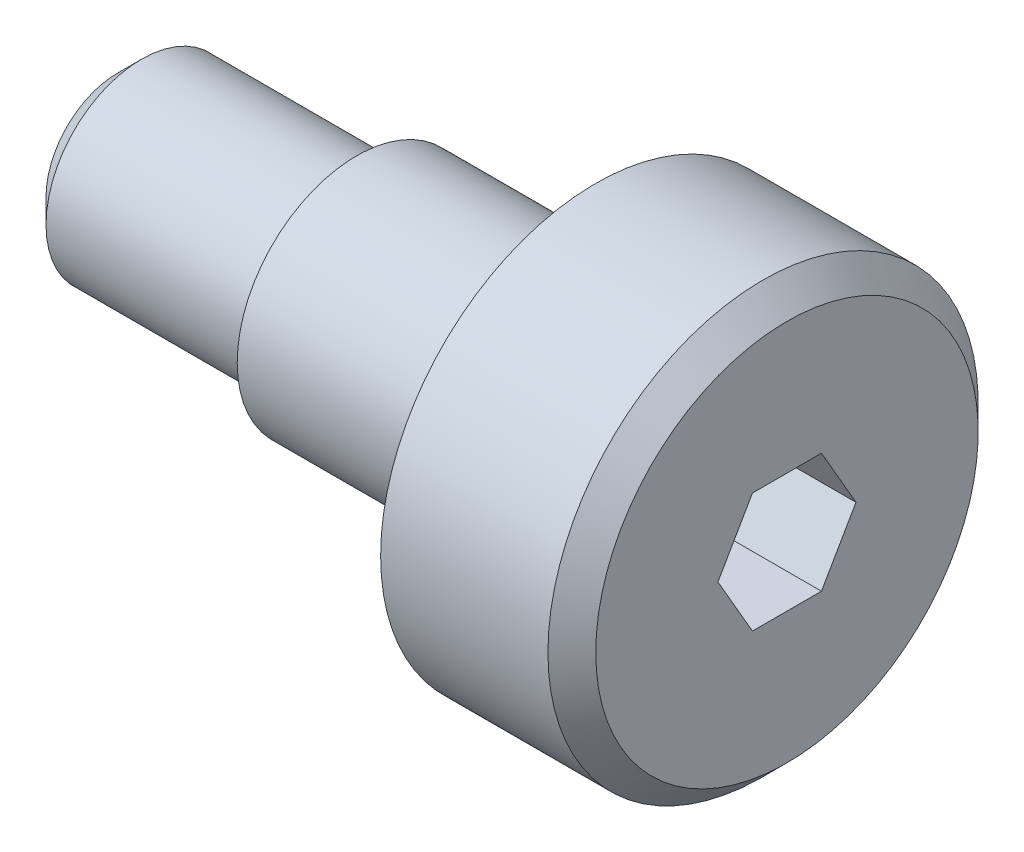
ISO-10303-21;
HEADER;
FILE_DESCRIPTION(('STEP AP214'),'2;1');
FILE_NAME('part.step','',(''),(''),'','','');
FILE_SCHEMA(('AUTOMOTIVE_DESIGN { 1 0 10303 214 1 1 1 1 }'));
ENDSEC;
DATA;
#1=APPLICATION_CONTEXT('core data for automotive mechanical design processes');
#2=APPLICATION_PROTOCOL_DEFINITION('international standard','automotive_design',2000,#1);
#3=PRODUCT_CONTEXT('',#1,'mechanical');
#4=PRODUCT('Part','Part','',(#3));
#5=PRODUCT_RELATED_PRODUCT_CATEGORY('part','',(#4));
#6=PRODUCT_DEFINITION_FORMATION('','',#4);
#7=PRODUCT_DEFINITION_CONTEXT('part definition',#1,'design');
#8=PRODUCT_DEFINITION('design','',#6,#7);
#9=PRODUCT_DEFINITION_SHAPE('','',#8);
#10=(LENGTH_UNIT() NAMED_UNIT(*) SI_UNIT(.MILLI.,.METRE.));
#11=(NAMED_UNIT(*) PLANE_ANGLE_UNIT() SI_UNIT($,.RADIAN.));
#12=(NAMED_UNIT(*) SI_UNIT($,.STERADIAN.) SOLID_ANGLE_UNIT());
#13=UNCERTAINTY_MEASURE_WITH_UNIT(LENGTH_MEASURE(1.E-05),#10,'distance_accuracy_value','');
#14=(GEOMETRIC_REPRESENTATION_CONTEXT(3) GLOBAL_UNCERTAINTY_ASSIGNED_CONTEXT((#13)) GLOBAL_UNIT_ASSIGNED_CONTEXT((#10,
#11,#12)) REPRESENTATION_CONTEXT('',''));
#15=CARTESIAN_POINT('',(0.,0.,0.));
#16=DIRECTION('',(0.,0.,1.));
#17=DIRECTION('',(1.,0.,0.));
#18=AXIS2_PLACEMENT_3D('',#15,#16,#17);
#19=CARTESIAN_POINT('',(0.,1.5,0.));
#20=DIRECTION('',(1.,0.,0.));
#21=DIRECTION('',(0.,0.,-1.));
#22=AXIS2_PLACEMENT_3D('',#19,#20,#21);
#23=PLANE('',#22);
#24=CARTESIAN_POINT('',(0.,0.,0.));
#25=DIRECTION('',(-1.,0.,0.));
#26=DIRECTION('',(0.,0.,1.));
#27=AXIS2_PLACEMENT_3D('',#24,#25,#26);
#28=CIRCLE('',#27,1.5);
#29=CARTESIAN_POINT('',(0.,0.,1.5));
#30=VERTEX_POINT('',#29);
#31=EDGE_CURVE('E138',#30,#30,#28,.T.);
#32=ORIENTED_EDGE('',*,*,#31,.T.);
#33=EDGE_LOOP('',(#32));
#34=FACE_BOUND('',#33,.T.);
#35=ADVANCED_FACE('F37',(#34),#23,.F.);
#36=CARTESIAN_POINT('',(14.,0.,0.));
#37=DIRECTION('',(-1.,0.,0.));
#38=DIRECTION('',(0.,0.,1.));
#39=AXIS2_PLACEMENT_3D('',#36,#37,#38);
#40=PLANE('',#39);
#41=DIRECTION('',(0.,0.866025403784438,0.5));
#42=VECTOR('',#41,1.);
#43=CARTESIAN_POINT('',(14.,0.,-1.44337567297407));
#44=LINE('',#43,#42);
#45=CARTESIAN_POINT('',(14.,0.,-1.44337567297407));
#46=VERTEX_POINT('',#45);
#47=CARTESIAN_POINT('',(14.,1.25,-0.721687836487032));
#48=VERTEX_POINT('',#47);
#49=EDGE_CURVE('E125',#46,#48,#44,.T.);
#50=ORIENTED_EDGE('',*,*,#49,.F.);
#51=DIRECTION('',(0.,0.866025403784439,-0.5));
#52=VECTOR('',#51,1.);
#53=CARTESIAN_POINT('',(14.,-1.25,-0.721687836487033));
#54=LINE('',#53,#52);
#55=CARTESIAN_POINT('',(14.,-1.25,-0.721687836487033));
#56=VERTEX_POINT('',#55);
#57=EDGE_CURVE('E51',#56,#46,#54,.T.);
#58=ORIENTED_EDGE('',*,*,#57,.F.);
#59=DIRECTION('',(0.,0.,-1.));
#60=VECTOR('',#59,1.);
#61=CARTESIAN_POINT('',(14.,-1.25,0.721687836487031));
#62=LINE('',#61,#60);
#63=CARTESIAN_POINT('',(14.,-1.25,0.721687836487031));
#64=VERTEX_POINT('',#63);
#65=EDGE_CURVE('E134',#64,#56,#62,.T.);
#66=ORIENTED_EDGE('',*,*,#65,.F.);
#67=DIRECTION('',(0.,-0.866025403784438,-0.5));
#68=VECTOR('',#67,1.);
#69=CARTESIAN_POINT('',(14.,0.,1.44337567297406));
#70=LINE('',#69,#68);
#71=CARTESIAN_POINT('',(14.,0.,1.44337567297406));
#72=VERTEX_POINT('',#71);
#73=EDGE_CURVE('E132',#72,#64,#70,.T.);
#74=ORIENTED_EDGE('',*,*,#73,.F.);
#75=DIRECTION('',(0.,-0.866025403784438,0.5));
#76=VECTOR('',#75,1.);
#77=CARTESIAN_POINT('',(14.,1.25,0.721687836487031));
#78=LINE('',#77,#76);
#79=CARTESIAN_POINT('',(14.,1.25,0.721687836487031));
#80=VERTEX_POINT('',#79);
#81=EDGE_CURVE('E99',#80,#72,#78,.T.);
#82=ORIENTED_EDGE('',*,*,#81,.F.);
#83=DIRECTION('',(0.,0.,1.));
#84=VECTOR('',#83,1.);
#85=CARTESIAN_POINT('',(14.,1.25,-0.721687836487032));
#86=LINE('',#85,#84);
#87=EDGE_CURVE('E128',#48,#80,#86,.T.);
#88=ORIENTED_EDGE('',*,*,#87,.F.);
#89=EDGE_LOOP('',(#50,#58,#66,#74,#82,#88));
#90=FACE_BOUND('',#89,.T.);
#91=CARTESIAN_POINT('',(14.,0.,0.));
#92=DIRECTION('',(-1.,0.,0.));
#93=DIRECTION('',(0.,0.,1.));
#94=AXIS2_PLACEMENT_3D('',#91,#92,#93);
#95=CIRCLE('',#94,4.);
#96=CARTESIAN_POINT('',(14.,0.,4.));
#97=VERTEX_POINT('',#96);
#98=EDGE_CURVE('E11',#97,#97,#95,.T.);
#99=ORIENTED_EDGE('',*,*,#98,.F.);
#100=EDGE_LOOP('',(#99));
#101=FACE_BOUND('',#100,.T.);
#102=ADVANCED_FACE('F168',(#90,#101),#40,.F.);
#103=CARTESIAN_POINT('',(14.,0.,0.));
#104=DIRECTION('',(-1.,0.,0.));
#105=DIRECTION('',(0.,0.,1.));
#106=AXIS2_PLACEMENT_3D('',#103,#104,#105);
#107=CONICAL_SURFACE('',#106,4.,0.785398163397446);
#108=CARTESIAN_POINT('',(13.5,0.,0.));
#109=DIRECTION('',(-1.,0.,0.));
#110=DIRECTION('',(0.,0.,1.));
#111=AXIS2_PLACEMENT_3D('',#108,#109,#110);
#112=CIRCLE('',#111,4.5);
#113=CARTESIAN_POINT('',(13.5,0.,4.5));
#114=VERTEX_POINT('',#113);
#115=EDGE_CURVE('E44',#114,#114,#112,.T.);
#116=ORIENTED_EDGE('',*,*,#115,.F.);
#117=EDGE_LOOP('',(#116));
#118=FACE_BOUND('',#117,.T.);
#119=ORIENTED_EDGE('',*,*,#98,.T.);
#120=EDGE_LOOP('',(#119));
#121=FACE_BOUND('',#120,.T.);
#122=ADVANCED_FACE('F165',(#118,#121),#107,.T.);
#123=CARTESIAN_POINT('',(0.,0.,0.));
#124=DIRECTION('',(-1.,0.,0.));
#125=DIRECTION('',(0.,0.,1.));
#126=AXIS2_PLACEMENT_3D('',#123,#124,#125);
#127=CYLINDRICAL_SURFACE('',#126,4.5);
#128=CARTESIAN_POINT('',(10.,0.,0.));
#129=DIRECTION('',(-1.,0.,0.));
#130=DIRECTION('',(0.,0.,1.));
#131=AXIS2_PLACEMENT_3D('',#128,#129,#130);
#132=CIRCLE('',#131,4.5);
#133=CARTESIAN_POINT('',(10.,0.,4.5));
#134=VERTEX_POINT('',#133);
#135=EDGE_CURVE('E158',#134,#134,#132,.T.);
#136=ORIENTED_EDGE('',*,*,#135,.F.);
#137=EDGE_LOOP('',(#136));
#138=FACE_BOUND('',#137,.T.);
#139=ORIENTED_EDGE('',*,*,#115,.T.);
#140=EDGE_LOOP('',(#139));
#141=FACE_BOUND('',#140,.T.);
#142=ADVANCED_FACE('F163',(#138,#141),#127,.T.);
#143=CARTESIAN_POINT('',(10.,4.5,0.));
#144=DIRECTION('',(1.,0.,0.));
#145=DIRECTION('',(0.,0.,-1.));
#146=AXIS2_PLACEMENT_3D('',#143,#144,#145);
#147=PLANE('',#146);
#148=CARTESIAN_POINT('',(10.,0.,0.));
#149=DIRECTION('',(-1.,0.,0.));
#150=DIRECTION('',(0.,0.,1.));
#151=AXIS2_PLACEMENT_3D('',#148,#149,#150);
#152=CIRCLE('',#151,2.5);
#153=CARTESIAN_POINT('',(10.,0.,2.5));
#154=VERTEX_POINT('',#153);
#155=EDGE_CURVE('E155',#154,#154,#152,.T.);
#156=ORIENTED_EDGE('',*,*,#155,.F.);
#157=EDGE_LOOP('',(#156));
#158=FACE_BOUND('',#157,.T.);
#159=ORIENTED_EDGE('',*,*,#135,.T.);
#160=EDGE_LOOP('',(#159));
#161=FACE_BOUND('',#160,.T.);
#162=ADVANCED_FACE('F184',(#158,#161),#147,.F.);
#163=CARTESIAN_POINT('',(0.,0.,0.));
#164=DIRECTION('',(-1.,0.,0.));
#165=DIRECTION('',(0.,0.,1.));
#166=AXIS2_PLACEMENT_3D('',#163,#164,#165);
#167=CYLINDRICAL_SURFACE('',#166,2.5);
#168=CARTESIAN_POINT('',(5.,0.,0.));
#169=DIRECTION('',(-1.,0.,0.));
#170=DIRECTION('',(0.,0.,1.));
#171=AXIS2_PLACEMENT_3D('',#168,#169,#170);
#172=CIRCLE('',#171,2.5);
#173=CARTESIAN_POINT('',(5.,0.,2.5));
#174=VERTEX_POINT('',#173);
#175=EDGE_CURVE('E152',#174,#174,#172,.T.);
#176=ORIENTED_EDGE('',*,*,#175,.F.);
#177=EDGE_LOOP('',(#176));
#178=FACE_BOUND('',#177,.T.);
#179=ORIENTED_EDGE('',*,*,#155,.T.);
#180=EDGE_LOOP('',(#179));
#181=FACE_BOUND('',#180,.T.);
#182=ADVANCED_FACE('F188',(#178,#181),#167,.T.);
#183=CARTESIAN_POINT('',(5.,2.5,0.));
#184=DIRECTION('',(1.,0.,0.));
#185=DIRECTION('',(0.,0.,-1.));
#186=AXIS2_PLACEMENT_3D('',#183,#184,#185);
#187=PLANE('',#186);
#188=CARTESIAN_POINT('',(5.,0.,0.));
#189=DIRECTION('',(-1.,0.,0.));
#190=DIRECTION('',(0.,0.,1.));
#191=AXIS2_PLACEMENT_3D('',#188,#189,#190);
#192=CIRCLE('',#191,2.);
#193=CARTESIAN_POINT('',(5.,0.,2.));
#194=VERTEX_POINT('',#193);
#195=EDGE_CURVE('E149',#194,#194,#192,.T.);
#196=ORIENTED_EDGE('',*,*,#195,.F.);
#197=EDGE_LOOP('',(#196));
#198=FACE_BOUND('',#197,.T.);
#199=ORIENTED_EDGE('',*,*,#175,.T.);
#200=EDGE_LOOP('',(#199));
#201=FACE_BOUND('',#200,.T.);
#202=ADVANCED_FACE('F192',(#198,#201),#187,.F.);
#203=CARTESIAN_POINT('',(0.,0.,0.));
#204=DIRECTION('',(-1.,0.,0.));
#205=DIRECTION('',(0.,0.,1.));
#206=AXIS2_PLACEMENT_3D('',#203,#204,#205);
#207=CYLINDRICAL_SURFACE('',#206,2.);
#208=CARTESIAN_POINT('',(0.5,0.,0.));
#209=DIRECTION('',(-1.,0.,0.));
#210=DIRECTION('',(0.,0.,1.));
#211=AXIS2_PLACEMENT_3D('',#208,#209,#210);
#212=CIRCLE('',#211,2.);
#213=CARTESIAN_POINT('',(0.5,0.,2.));
#214=VERTEX_POINT('',#213);
#215=EDGE_CURVE('E146',#214,#214,#212,.T.);
#216=ORIENTED_EDGE('',*,*,#215,.F.);
#217=EDGE_LOOP('',(#216));
#218=FACE_BOUND('',#217,.T.);
#219=ORIENTED_EDGE('',*,*,#195,.T.);
#220=EDGE_LOOP('',(#219));
#221=FACE_BOUND('',#220,.T.);
#222=ADVANCED_FACE('F196',(#218,#221),#207,.T.);
#223=CARTESIAN_POINT('',(0.5,0.,0.));
#224=DIRECTION('',(1.,0.,0.));
#225=DIRECTION('',(0.,0.,-1.));
#226=AXIS2_PLACEMENT_3D('',#223,#224,#225);
#227=CONICAL_SURFACE('',#226,2.,0.785398163397448);
#228=ORIENTED_EDGE('',*,*,#31,.F.);
#229=EDGE_LOOP('',(#228));
#230=FACE_BOUND('',#229,.T.);
#231=ORIENTED_EDGE('',*,*,#215,.T.);
#232=EDGE_LOOP('',(#231));
#233=FACE_BOUND('',#232,.T.);
#234=ADVANCED_FACE('F200',(#230,#233),#227,.T.);
#235=CARTESIAN_POINT('',(10.,-1.25,-0.721687836487033));
#236=DIRECTION('',(0.,-0.5,-0.866025403784439));
#237=DIRECTION('',(0.,0.866025403784439,-0.5));
#238=AXIS2_PLACEMENT_3D('',#235,#236,#237);
#239=PLANE('',#238);
#240=ORIENTED_EDGE('',*,*,#57,.T.);
#241=DIRECTION('',(1.,0.,0.));
#242=VECTOR('',#241,1.);
#243=CARTESIAN_POINT('',(10.,0.,-1.44337567297407));
#244=LINE('',#243,#242);
#245=CARTESIAN_POINT('',(10.,0.,-1.44337567297407));
#246=VERTEX_POINT('',#245);
#247=EDGE_CURVE('E81',#246,#46,#244,.T.);
#248=ORIENTED_EDGE('',*,*,#247,.F.);
#249=DIRECTION('',(0.,0.866025403784439,-0.5));
#250=VECTOR('',#249,1.);
#251=CARTESIAN_POINT('',(10.,-1.25,-0.721687836487033));
#252=LINE('',#251,#250);
#253=CARTESIAN_POINT('',(10.,-1.25,-0.721687836487033));
#254=VERTEX_POINT('',#253);
#255=EDGE_CURVE('E136',#254,#246,#252,.T.);
#256=ORIENTED_EDGE('',*,*,#255,.F.);
#257=DIRECTION('',(1.,0.,0.));
#258=VECTOR('',#257,1.);
#259=CARTESIAN_POINT('',(10.,-1.25,-0.721687836487033));
#260=LINE('',#259,#258);
#261=EDGE_CURVE('E59',#254,#56,#260,.T.);
#262=ORIENTED_EDGE('',*,*,#261,.T.);
#263=EDGE_LOOP('',(#240,#248,#256,#262));
#264=FACE_BOUND('',#263,.T.);
#265=ADVANCED_FACE('F203',(#264),#239,.F.);
#266=CARTESIAN_POINT('',(10.,-1.25,0.721687836487031));
#267=DIRECTION('',(0.,-1.,0.));
#268=DIRECTION('',(0.,0.,-1.));
#269=AXIS2_PLACEMENT_3D('',#266,#267,#268);
#270=PLANE('',#269);
#271=ORIENTED_EDGE('',*,*,#65,.T.);
#272=ORIENTED_EDGE('',*,*,#261,.F.);
#273=DIRECTION('',(0.,0.,-1.));
#274=VECTOR('',#273,1.);
#275=CARTESIAN_POINT('',(10.,-1.25,0.721687836487031));
#276=LINE('',#275,#274);
#277=CARTESIAN_POINT('',(10.,-1.25,0.721687836487031));
#278=VERTEX_POINT('',#277);
#279=EDGE_CURVE('E111',#278,#254,#276,.T.);
#280=ORIENTED_EDGE('',*,*,#279,.F.);
#281=DIRECTION('',(1.,0.,0.));
#282=VECTOR('',#281,1.);
#283=CARTESIAN_POINT('',(10.,-1.25,0.721687836487031));
#284=LINE('',#283,#282);
#285=EDGE_CURVE('E103',#278,#64,#284,.T.);
#286=ORIENTED_EDGE('',*,*,#285,.T.);
#287=EDGE_LOOP('',(#271,#272,#280,#286));
#288=FACE_BOUND('',#287,.T.);
#289=ADVANCED_FACE('F206',(#288),#270,.F.);
#290=CARTESIAN_POINT('',(10.,0.,1.44337567297406));
#291=DIRECTION('',(0.,-0.5,0.866025403784438));
#292=DIRECTION('',(0.,-0.866025403784438,-0.5));
#293=AXIS2_PLACEMENT_3D('',#290,#291,#292);
#294=PLANE('',#293);
#295=ORIENTED_EDGE('',*,*,#73,.T.);
#296=ORIENTED_EDGE('',*,*,#285,.F.);
#297=DIRECTION('',(0.,-0.866025403784438,-0.5));
#298=VECTOR('',#297,1.);
#299=CARTESIAN_POINT('',(10.,0.,1.44337567297406));
#300=LINE('',#299,#298);
#301=CARTESIAN_POINT('',(10.,0.,1.44337567297406));
#302=VERTEX_POINT('',#301);
#303=EDGE_CURVE('E107',#302,#278,#300,.T.);
#304=ORIENTED_EDGE('',*,*,#303,.F.);
#305=DIRECTION('',(1.,0.,0.));
#306=VECTOR('',#305,1.);
#307=CARTESIAN_POINT('',(10.,0.,1.44337567297406));
#308=LINE('',#307,#306);
#309=EDGE_CURVE('E92',#302,#72,#308,.T.);
#310=ORIENTED_EDGE('',*,*,#309,.T.);
#311=EDGE_LOOP('',(#295,#296,#304,#310));
#312=FACE_BOUND('',#311,.T.);
#313=ADVANCED_FACE('F108',(#312),#294,.F.);
#314=CARTESIAN_POINT('',(10.,1.25,0.721687836487031));
#315=DIRECTION('',(0.,0.5,0.866025403784439));
#316=DIRECTION('',(0.,-0.866025403784438,0.5));
#317=AXIS2_PLACEMENT_3D('',#314,#315,#316);
#318=PLANE('',#317);
#319=ORIENTED_EDGE('',*,*,#81,.T.);
#320=ORIENTED_EDGE('',*,*,#309,.F.);
#321=DIRECTION('',(0.,-0.866025403784438,0.5));
#322=VECTOR('',#321,1.);
#323=CARTESIAN_POINT('',(10.,1.25,0.721687836487031));
#324=LINE('',#323,#322);
#325=CARTESIAN_POINT('',(10.,1.25,0.721687836487031));
#326=VERTEX_POINT('',#325);
#327=EDGE_CURVE('E96',#326,#302,#324,.T.);
#328=ORIENTED_EDGE('',*,*,#327,.F.);
#329=DIRECTION('',(1.,0.,0.));
#330=VECTOR('',#329,1.);
#331=CARTESIAN_POINT('',(10.,1.25,0.721687836487031));
#332=LINE('',#331,#330);
#333=EDGE_CURVE('E104',#326,#80,#332,.T.);
#334=ORIENTED_EDGE('',*,*,#333,.T.);
#335=EDGE_LOOP('',(#319,#320,#328,#334));
#336=FACE_BOUND('',#335,.T.);
#337=ADVANCED_FACE('F94',(#336),#318,.F.);
#338=CARTESIAN_POINT('',(10.,1.25,-0.721687836487032));
#339=DIRECTION('',(0.,1.,0.));
#340=DIRECTION('',(0.,0.,1.));
#341=AXIS2_PLACEMENT_3D('',#338,#339,#340);
#342=PLANE('',#341);
#343=ORIENTED_EDGE('',*,*,#87,.T.);
#344=ORIENTED_EDGE('',*,*,#333,.F.);
#345=DIRECTION('',(0.,0.,1.));
#346=VECTOR('',#345,1.);
#347=CARTESIAN_POINT('',(10.,1.25,-0.721687836487032));
#348=LINE('',#347,#346);
#349=CARTESIAN_POINT('',(10.,1.25,-0.721687836487032));
#350=VERTEX_POINT('',#349);
#351=EDGE_CURVE('E117',#350,#326,#348,.T.);
#352=ORIENTED_EDGE('',*,*,#351,.F.);
#353=DIRECTION('',(1.,0.,0.));
#354=VECTOR('',#353,1.);
#355=CARTESIAN_POINT('',(10.,1.25,-0.721687836487032));
#356=LINE('',#355,#354);
#357=EDGE_CURVE('E141',#350,#48,#356,.T.);
#358=ORIENTED_EDGE('',*,*,#357,.T.);
#359=EDGE_LOOP('',(#343,#344,#352,#358));
#360=FACE_BOUND('',#359,.T.);
#361=ADVANCED_FACE('F210',(#360),#342,.F.);
#362=CARTESIAN_POINT('',(10.,0.,-1.44337567297407));
#363=DIRECTION('',(0.,0.5,-0.866025403784438));
#364=DIRECTION('',(0.,0.866025403784438,0.5));
#365=AXIS2_PLACEMENT_3D('',#362,#363,#364);
#366=PLANE('',#365);
#367=ORIENTED_EDGE('',*,*,#49,.T.);
#368=ORIENTED_EDGE('',*,*,#357,.F.);
#369=DIRECTION('',(0.,0.866025403784438,0.5));
#370=VECTOR('',#369,1.);
#371=CARTESIAN_POINT('',(10.,0.,-1.44337567297407));
#372=LINE('',#371,#370);
#373=EDGE_CURVE('E119',#246,#350,#372,.T.);
#374=ORIENTED_EDGE('',*,*,#373,.F.);
#375=ORIENTED_EDGE('',*,*,#247,.T.);
#376=EDGE_LOOP('',(#367,#368,#374,#375));
#377=FACE_BOUND('',#376,.T.);
#378=ADVANCED_FACE('F207',(#377),#366,.F.);
#379=CARTESIAN_POINT('',(10.,0.,0.));
#380=DIRECTION('',(1.,0.,0.));
#381=DIRECTION('',(0.,0.,-1.));
#382=AXIS2_PLACEMENT_3D('',#379,#380,#381);
#383=PLANE('',#382);
#384=ORIENTED_EDGE('',*,*,#255,.T.);
#385=ORIENTED_EDGE('',*,*,#373,.T.);
#386=ORIENTED_EDGE('',*,*,#351,.T.);
#387=ORIENTED_EDGE('',*,*,#327,.T.);
#388=ORIENTED_EDGE('',*,*,#303,.T.);
#389=ORIENTED_EDGE('',*,*,#279,.T.);
#390=EDGE_LOOP('',(#384,#385,#386,#387,#388,#389));
#391=FACE_BOUND('',#390,.T.);
#392=ADVANCED_FACE('F114',(#391),#383,.T.);
#393=CLOSED_SHELL('',(#35,#102,#122,#142,#162,#182,#202,#222,#234,#265,#289,#313,#337,#361,#378,#392));
#394=MANIFOLD_SOLID_BREP('B2',#393);
#395=ADVANCED_BREP_SHAPE_REPRESENTATION('',(#18,#394),#14);
#396=SHAPE_DEFINITION_REPRESENTATION(#9,#395);
ENDSEC;
END-ISO-10303-21;
